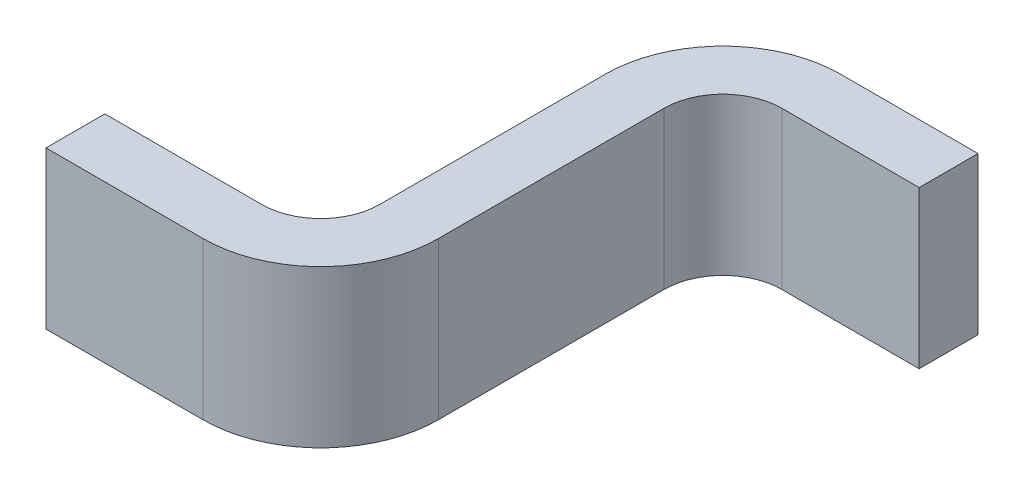
ISO-10303-21;
HEADER;
FILE_DESCRIPTION(('STEP AP214'),'2;1');
FILE_NAME('part.step','',(''),(''),'','','');
FILE_SCHEMA(('AUTOMOTIVE_DESIGN { 1 0 10303 214 1 1 1 1 }'));
ENDSEC;
DATA;
#1=APPLICATION_CONTEXT('core data for automotive mechanical design processes');
#2=APPLICATION_PROTOCOL_DEFINITION('international standard','automotive_design',2000,#1);
#3=PRODUCT_CONTEXT('',#1,'mechanical');
#4=PRODUCT('Part','Part','',(#3));
#5=PRODUCT_RELATED_PRODUCT_CATEGORY('part','',(#4));
#6=PRODUCT_DEFINITION_FORMATION('','',#4);
#7=PRODUCT_DEFINITION_CONTEXT('part definition',#1,'design');
#8=PRODUCT_DEFINITION('design','',#6,#7);
#9=PRODUCT_DEFINITION_SHAPE('','',#8);
#10=(LENGTH_UNIT() NAMED_UNIT(*) SI_UNIT(.MILLI.,.METRE.));
#11=(NAMED_UNIT(*) PLANE_ANGLE_UNIT() SI_UNIT($,.RADIAN.));
#12=(NAMED_UNIT(*) SI_UNIT($,.STERADIAN.) SOLID_ANGLE_UNIT());
#13=UNCERTAINTY_MEASURE_WITH_UNIT(LENGTH_MEASURE(1.E-05),#10,'distance_accuracy_value','');
#14=(GEOMETRIC_REPRESENTATION_CONTEXT(3) GLOBAL_UNCERTAINTY_ASSIGNED_CONTEXT((#13)) GLOBAL_UNIT_ASSIGNED_CONTEXT((#10,
#11,#12)) REPRESENTATION_CONTEXT('',''));
#15=CARTESIAN_POINT('',(0.,0.,0.));
#16=DIRECTION('',(0.,0.,1.));
#17=DIRECTION('',(1.,0.,0.));
#18=AXIS2_PLACEMENT_3D('',#15,#16,#17);
#19=CARTESIAN_POINT('',(3.15,1.47,0.));
#20=DIRECTION('',(0.,1.,0.));
#21=DIRECTION('',(1.,0.,0.));
#22=AXIS2_PLACEMENT_3D('',#19,#20,#21);
#23=PLANE('',#22);
#24=DIRECTION('',(-1.,0.,0.));
#25=VECTOR('',#24,1.);
#26=CARTESIAN_POINT('',(-2.475,1.47,0.));
#27=LINE('',#26,#25);
#28=CARTESIAN_POINT('',(3.4,1.47,0.));
#29=VERTEX_POINT('',#28);
#30=CARTESIAN_POINT('',(3.05,1.47,0.));
#31=VERTEX_POINT('',#30);
#32=EDGE_CURVE('E11',#29,#31,#27,.T.);
#33=ORIENTED_EDGE('',*,*,#32,.T.);
#34=CARTESIAN_POINT('',(3.05,1.47,0.3));
#35=DIRECTION('',(0.,-1.,0.));
#36=DIRECTION('',(0.,0.,-1.));
#37=AXIS2_PLACEMENT_3D('',#34,#35,#36);
#38=CIRCLE('',#37,0.3);
#39=CARTESIAN_POINT('',(2.75,1.47,0.3));
#40=VERTEX_POINT('',#39);
#41=EDGE_CURVE('E188',#40,#31,#38,.T.);
#42=ORIENTED_EDGE('',*,*,#41,.F.);
#43=DIRECTION('',(0.,0.,-1.));
#44=VECTOR('',#43,1.);
#45=CARTESIAN_POINT('',(2.75,1.47,1.175));
#46=LINE('',#45,#44);
#47=CARTESIAN_POINT('',(2.75,1.47,0.875));
#48=VERTEX_POINT('',#47);
#49=EDGE_CURVE('E200',#48,#40,#46,.T.);
#50=ORIENTED_EDGE('',*,*,#49,.F.);
#51=CARTESIAN_POINT('',(2.6,1.47,0.875));
#52=DIRECTION('',(0.,-1.,0.));
#53=DIRECTION('',(0.,0.,-1.));
#54=AXIS2_PLACEMENT_3D('',#51,#52,#53);
#55=CIRCLE('',#54,0.15);
#56=CARTESIAN_POINT('',(2.6,1.47,1.025));
#57=VERTEX_POINT('',#56);
#58=EDGE_CURVE('E203',#48,#57,#55,.T.);
#59=ORIENTED_EDGE('',*,*,#58,.T.);
#60=DIRECTION('',(-1.,0.,0.));
#61=VECTOR('',#60,1.);
#62=CARTESIAN_POINT('',(0.,1.47,1.025));
#63=LINE('',#62,#61);
#64=CARTESIAN_POINT('',(2.2,1.47,1.025));
#65=VERTEX_POINT('',#64);
#66=EDGE_CURVE('E210',#57,#65,#63,.T.);
#67=ORIENTED_EDGE('',*,*,#66,.T.);
#68=DIRECTION('',(0.,0.,-1.));
#69=VECTOR('',#68,1.);
#70=CARTESIAN_POINT('',(2.2,1.47,1.1));
#71=LINE('',#70,#69);
#72=CARTESIAN_POINT('',(2.2,1.47,1.175));
#73=VERTEX_POINT('',#72);
#74=EDGE_CURVE('E215',#73,#65,#71,.T.);
#75=ORIENTED_EDGE('',*,*,#74,.F.);
#76=DIRECTION('',(-1.,0.,0.));
#77=VECTOR('',#76,1.);
#78=CARTESIAN_POINT('',(-2.475,1.47,1.175));
#79=LINE('',#78,#77);
#80=CARTESIAN_POINT('',(2.6,1.47,1.175));
#81=VERTEX_POINT('',#80);
#82=EDGE_CURVE('E150',#81,#73,#79,.T.);
#83=ORIENTED_EDGE('',*,*,#82,.F.);
#84=CARTESIAN_POINT('',(2.6,1.47,0.875));
#85=DIRECTION('',(0.,-1.,0.));
#86=DIRECTION('',(0.,0.,-1.));
#87=AXIS2_PLACEMENT_3D('',#84,#85,#86);
#88=CIRCLE('',#87,0.3);
#89=CARTESIAN_POINT('',(2.9,1.47,0.875));
#90=VERTEX_POINT('',#89);
#91=EDGE_CURVE('E149',#90,#81,#88,.T.);
#92=ORIENTED_EDGE('',*,*,#91,.F.);
#93=DIRECTION('',(0.,0.,1.));
#94=VECTOR('',#93,1.);
#95=CARTESIAN_POINT('',(2.9,1.47,1.175));
#96=LINE('',#95,#94);
#97=CARTESIAN_POINT('',(2.9,1.47,0.3));
#98=VERTEX_POINT('',#97);
#99=EDGE_CURVE('E145',#98,#90,#96,.T.);
#100=ORIENTED_EDGE('',*,*,#99,.F.);
#101=CARTESIAN_POINT('',(3.05,1.47,0.3));
#102=DIRECTION('',(0.,-1.,0.));
#103=DIRECTION('',(0.,0.,-1.));
#104=AXIS2_PLACEMENT_3D('',#101,#102,#103);
#105=CIRCLE('',#104,0.15);
#106=CARTESIAN_POINT('',(3.05,1.47,0.15));
#107=VERTEX_POINT('',#106);
#108=EDGE_CURVE('E198',#98,#107,#105,.T.);
#109=ORIENTED_EDGE('',*,*,#108,.T.);
#110=DIRECTION('',(-1.,0.,0.));
#111=VECTOR('',#110,1.);
#112=CARTESIAN_POINT('',(0.,1.47,0.15));
#113=LINE('',#112,#111);
#114=CARTESIAN_POINT('',(3.4,1.47,0.15));
#115=VERTEX_POINT('',#114);
#116=EDGE_CURVE('E236',#115,#107,#113,.T.);
#117=ORIENTED_EDGE('',*,*,#116,.F.);
#118=DIRECTION('',(0.,0.,1.));
#119=VECTOR('',#118,1.);
#120=CARTESIAN_POINT('',(3.4,1.47,0.));
#121=LINE('',#120,#119);
#122=EDGE_CURVE('E26',#29,#115,#121,.T.);
#123=ORIENTED_EDGE('',*,*,#122,.F.);
#124=EDGE_LOOP('',(#33,#42,#50,#59,#67,#75,#83,#92,#100,#109,#117,#123));
#125=FACE_BOUND('',#124,.T.);
#126=ADVANCED_FACE('F17',(#125),#23,.T.);
#127=CARTESIAN_POINT('',(-2.475,1.27,0.));
#128=DIRECTION('',(0.,0.,1.));
#129=DIRECTION('',(1.,0.,0.));
#130=AXIS2_PLACEMENT_3D('',#127,#128,#129);
#131=PLANE('',#130);
#132=ORIENTED_EDGE('',*,*,#32,.F.);
#133=DIRECTION('',(0.,1.,0.));
#134=VECTOR('',#133,1.);
#135=CARTESIAN_POINT('',(3.4,1.27,0.));
#136=LINE('',#135,#134);
#137=CARTESIAN_POINT('',(3.4,1.07,0.));
#138=VERTEX_POINT('',#137);
#139=EDGE_CURVE('E239',#138,#29,#136,.T.);
#140=ORIENTED_EDGE('',*,*,#139,.F.);
#141=DIRECTION('',(1.,0.,0.));
#142=VECTOR('',#141,1.);
#143=CARTESIAN_POINT('',(2.825,1.07,0.));
#144=LINE('',#143,#142);
#145=CARTESIAN_POINT('',(3.05,1.07,0.));
#146=VERTEX_POINT('',#145);
#147=EDGE_CURVE('E384',#146,#138,#144,.T.);
#148=ORIENTED_EDGE('',*,*,#147,.F.);
#149=DIRECTION('',(0.,-1.,0.));
#150=VECTOR('',#149,1.);
#151=CARTESIAN_POINT('',(3.05,1.27,0.));
#152=LINE('',#151,#150);
#153=EDGE_CURVE('E189',#31,#146,#152,.T.);
#154=ORIENTED_EDGE('',*,*,#153,.F.);
#155=EDGE_LOOP('',(#132,#140,#148,#154));
#156=FACE_BOUND('',#155,.T.);
#157=ADVANCED_FACE('F452',(#156),#131,.F.);
#158=CARTESIAN_POINT('',(3.4,1.27,0.));
#159=DIRECTION('',(1.,0.,0.));
#160=DIRECTION('',(0.,1.,0.));
#161=AXIS2_PLACEMENT_3D('',#158,#159,#160);
#162=PLANE('',#161);
#163=ORIENTED_EDGE('',*,*,#139,.T.);
#164=ORIENTED_EDGE('',*,*,#122,.T.);
#165=DIRECTION('',(0.,1.,0.));
#166=VECTOR('',#165,1.);
#167=CARTESIAN_POINT('',(3.4,0.,0.15));
#168=LINE('',#167,#166);
#169=CARTESIAN_POINT('',(3.4,1.07,0.15));
#170=VERTEX_POINT('',#169);
#171=EDGE_CURVE('E232',#170,#115,#168,.T.);
#172=ORIENTED_EDGE('',*,*,#171,.F.);
#173=DIRECTION('',(0.,0.,1.));
#174=VECTOR('',#173,1.);
#175=CARTESIAN_POINT('',(3.4,1.07,1.175));
#176=LINE('',#175,#174);
#177=EDGE_CURVE('E388',#138,#170,#176,.T.);
#178=ORIENTED_EDGE('',*,*,#177,.F.);
#179=EDGE_LOOP('',(#163,#164,#172,#178));
#180=FACE_BOUND('',#179,.T.);
#181=ADVANCED_FACE('F453',(#180),#162,.T.);
#182=CARTESIAN_POINT('',(0.,0.,0.15));
#183=DIRECTION('',(0.,0.,1.));
#184=DIRECTION('',(1.,0.,0.));
#185=AXIS2_PLACEMENT_3D('',#182,#183,#184);
#186=PLANE('',#185);
#187=ORIENTED_EDGE('',*,*,#171,.T.);
#188=ORIENTED_EDGE('',*,*,#116,.T.);
#189=DIRECTION('',(0.,-1.,0.));
#190=VECTOR('',#189,1.);
#191=CARTESIAN_POINT('',(3.05,0.635,0.15));
#192=LINE('',#191,#190);
#193=CARTESIAN_POINT('',(3.05,1.07,0.15));
#194=VERTEX_POINT('',#193);
#195=EDGE_CURVE('E229',#107,#194,#192,.T.);
#196=ORIENTED_EDGE('',*,*,#195,.T.);
#197=DIRECTION('',(-1.,0.,0.));
#198=VECTOR('',#197,1.);
#199=CARTESIAN_POINT('',(2.825,1.07,0.15));
#200=LINE('',#199,#198);
#201=EDGE_CURVE('E174',#170,#194,#200,.T.);
#202=ORIENTED_EDGE('',*,*,#201,.F.);
#203=EDGE_LOOP('',(#187,#188,#196,#202));
#204=FACE_BOUND('',#203,.T.);
#205=ADVANCED_FACE('F19',(#204),#186,.T.);
#206=CARTESIAN_POINT('',(3.05,0.635,0.3));
#207=DIRECTION('',(0.,-1.,0.));
#208=DIRECTION('',(0.,0.,-1.));
#209=AXIS2_PLACEMENT_3D('',#206,#207,#208);
#210=CYLINDRICAL_SURFACE('',#209,0.15);
#211=ORIENTED_EDGE('',*,*,#108,.F.);
#212=DIRECTION('',(0.,1.,0.));
#213=VECTOR('',#212,1.);
#214=CARTESIAN_POINT('',(2.9,1.27,0.3));
#215=LINE('',#214,#213);
#216=CARTESIAN_POINT('',(2.9,1.07,0.3));
#217=VERTEX_POINT('',#216);
#218=EDGE_CURVE('E199',#217,#98,#215,.T.);
#219=ORIENTED_EDGE('',*,*,#218,.F.);
#220=CARTESIAN_POINT('',(3.05,1.07,0.3));
#221=DIRECTION('',(0.,1.,0.));
#222=DIRECTION('',(0.,0.,-1.));
#223=AXIS2_PLACEMENT_3D('',#220,#221,#222);
#224=CIRCLE('',#223,0.15);
#225=EDGE_CURVE('E167',#194,#217,#224,.T.);
#226=ORIENTED_EDGE('',*,*,#225,.F.);
#227=ORIENTED_EDGE('',*,*,#195,.F.);
#228=EDGE_LOOP('',(#211,#219,#226,#227));
#229=FACE_BOUND('',#228,.T.);
#230=ADVANCED_FACE('F427',(#229),#210,.F.);
#231=CARTESIAN_POINT('',(2.9,1.27,1.175));
#232=DIRECTION('',(1.,0.,0.));
#233=DIRECTION('',(0.,1.,0.));
#234=AXIS2_PLACEMENT_3D('',#231,#232,#233);
#235=PLANE('',#234);
#236=DIRECTION('',(0.,1.,0.));
#237=VECTOR('',#236,1.);
#238=CARTESIAN_POINT('',(2.9,1.27,0.875));
#239=LINE('',#238,#237);
#240=CARTESIAN_POINT('',(2.9,1.07,0.875));
#241=VERTEX_POINT('',#240);
#242=EDGE_CURVE('E137',#241,#90,#239,.T.);
#243=ORIENTED_EDGE('',*,*,#242,.F.);
#244=DIRECTION('',(0.,0.,1.));
#245=VECTOR('',#244,1.);
#246=CARTESIAN_POINT('',(2.9,1.07,1.175));
#247=LINE('',#246,#245);
#248=EDGE_CURVE('E142',#217,#241,#247,.T.);
#249=ORIENTED_EDGE('',*,*,#248,.F.);
#250=ORIENTED_EDGE('',*,*,#218,.T.);
#251=ORIENTED_EDGE('',*,*,#99,.T.);
#252=EDGE_LOOP('',(#243,#249,#250,#251));
#253=FACE_BOUND('',#252,.T.);
#254=ADVANCED_FACE('F139',(#253),#235,.T.);
#255=CARTESIAN_POINT('',(2.6,1.27,0.875));
#256=DIRECTION('',(0.,-1.,0.));
#257=DIRECTION('',(0.,0.,-1.));
#258=AXIS2_PLACEMENT_3D('',#255,#256,#257);
#259=CYLINDRICAL_SURFACE('',#258,0.3);
#260=DIRECTION('',(0.,1.,0.));
#261=VECTOR('',#260,1.);
#262=CARTESIAN_POINT('',(2.6,1.27,1.175));
#263=LINE('',#262,#261);
#264=CARTESIAN_POINT('',(2.6,1.07,1.175));
#265=VERTEX_POINT('',#264);
#266=EDGE_CURVE('E156',#265,#81,#263,.T.);
#267=ORIENTED_EDGE('',*,*,#266,.F.);
#268=CARTESIAN_POINT('',(2.6,1.07,0.875));
#269=DIRECTION('',(0.,-1.,0.));
#270=DIRECTION('',(0.,0.,-1.));
#271=AXIS2_PLACEMENT_3D('',#268,#269,#270);
#272=CIRCLE('',#271,0.3);
#273=EDGE_CURVE('E153',#241,#265,#272,.T.);
#274=ORIENTED_EDGE('',*,*,#273,.F.);
#275=ORIENTED_EDGE('',*,*,#242,.T.);
#276=ORIENTED_EDGE('',*,*,#91,.T.);
#277=EDGE_LOOP('',(#267,#274,#275,#276));
#278=FACE_BOUND('',#277,.T.);
#279=ADVANCED_FACE('F154',(#278),#259,.T.);
#280=CARTESIAN_POINT('',(-2.475,1.27,1.175));
#281=DIRECTION('',(0.,0.,1.));
#282=DIRECTION('',(1.,0.,0.));
#283=AXIS2_PLACEMENT_3D('',#280,#281,#282);
#284=PLANE('',#283);
#285=DIRECTION('',(0.,1.,0.));
#286=VECTOR('',#285,1.);
#287=CARTESIAN_POINT('',(2.2,1.27,1.175));
#288=LINE('',#287,#286);
#289=CARTESIAN_POINT('',(2.2,1.07,1.175));
#290=VERTEX_POINT('',#289);
#291=EDGE_CURVE('E214',#290,#73,#288,.T.);
#292=ORIENTED_EDGE('',*,*,#291,.F.);
#293=DIRECTION('',(-1.,0.,0.));
#294=VECTOR('',#293,1.);
#295=CARTESIAN_POINT('',(2.825,1.07,1.175));
#296=LINE('',#295,#294);
#297=EDGE_CURVE('E161',#265,#290,#296,.T.);
#298=ORIENTED_EDGE('',*,*,#297,.F.);
#299=ORIENTED_EDGE('',*,*,#266,.T.);
#300=ORIENTED_EDGE('',*,*,#82,.T.);
#301=EDGE_LOOP('',(#292,#298,#299,#300));
#302=FACE_BOUND('',#301,.T.);
#303=ADVANCED_FACE('F432',(#302),#284,.T.);
#304=CARTESIAN_POINT('',(2.2,1.27,1.1));
#305=DIRECTION('',(-1.,0.,0.));
#306=DIRECTION('',(0.,0.,1.));
#307=AXIS2_PLACEMENT_3D('',#304,#305,#306);
#308=PLANE('',#307);
#309=ORIENTED_EDGE('',*,*,#291,.T.);
#310=ORIENTED_EDGE('',*,*,#74,.T.);
#311=DIRECTION('',(0.,-1.,0.));
#312=VECTOR('',#311,1.);
#313=CARTESIAN_POINT('',(2.2,0.,1.025));
#314=LINE('',#313,#312);
#315=CARTESIAN_POINT('',(2.2,1.07,1.025));
#316=VERTEX_POINT('',#315);
#317=EDGE_CURVE('E207',#65,#316,#314,.T.);
#318=ORIENTED_EDGE('',*,*,#317,.T.);
#319=DIRECTION('',(0.,0.,-1.));
#320=VECTOR('',#319,1.);
#321=CARTESIAN_POINT('',(2.2,1.07,1.175));
#322=LINE('',#321,#320);
#323=EDGE_CURVE('E183',#290,#316,#322,.T.);
#324=ORIENTED_EDGE('',*,*,#323,.F.);
#325=EDGE_LOOP('',(#309,#310,#318,#324));
#326=FACE_BOUND('',#325,.T.);
#327=ADVANCED_FACE('F436',(#326),#308,.T.);
#328=CARTESIAN_POINT('',(0.,0.,1.025));
#329=DIRECTION('',(0.,0.,1.));
#330=DIRECTION('',(1.,0.,0.));
#331=AXIS2_PLACEMENT_3D('',#328,#329,#330);
#332=PLANE('',#331);
#333=DIRECTION('',(1.,0.,0.));
#334=VECTOR('',#333,1.);
#335=CARTESIAN_POINT('',(2.825,1.07,1.025));
#336=LINE('',#335,#334);
#337=CARTESIAN_POINT('',(2.6,1.07,1.025));
#338=VERTEX_POINT('',#337);
#339=EDGE_CURVE('E178',#316,#338,#336,.T.);
#340=ORIENTED_EDGE('',*,*,#339,.F.);
#341=ORIENTED_EDGE('',*,*,#317,.F.);
#342=ORIENTED_EDGE('',*,*,#66,.F.);
#343=DIRECTION('',(0.,-1.,0.));
#344=VECTOR('',#343,1.);
#345=CARTESIAN_POINT('',(2.6,0.635,1.025));
#346=LINE('',#345,#344);
#347=EDGE_CURVE('E204',#57,#338,#346,.T.);
#348=ORIENTED_EDGE('',*,*,#347,.T.);
#349=EDGE_LOOP('',(#340,#341,#342,#348));
#350=FACE_BOUND('',#349,.T.);
#351=ADVANCED_FACE('F439',(#350),#332,.F.);
#352=CARTESIAN_POINT('',(2.6,0.635,0.875));
#353=DIRECTION('',(0.,-1.,0.));
#354=DIRECTION('',(0.,0.,-1.));
#355=AXIS2_PLACEMENT_3D('',#352,#353,#354);
#356=CYLINDRICAL_SURFACE('',#355,0.15);
#357=ORIENTED_EDGE('',*,*,#58,.F.);
#358=DIRECTION('',(0.,1.,0.));
#359=VECTOR('',#358,1.);
#360=CARTESIAN_POINT('',(2.75,1.27,0.875));
#361=LINE('',#360,#359);
#362=CARTESIAN_POINT('',(2.75,1.07,0.875));
#363=VERTEX_POINT('',#362);
#364=EDGE_CURVE('E192',#363,#48,#361,.T.);
#365=ORIENTED_EDGE('',*,*,#364,.F.);
#366=CARTESIAN_POINT('',(2.6,1.07,0.875));
#367=DIRECTION('',(0.,1.,0.));
#368=DIRECTION('',(0.,0.,-1.));
#369=AXIS2_PLACEMENT_3D('',#366,#367,#368);
#370=CIRCLE('',#369,0.15);
#371=EDGE_CURVE('E182',#338,#363,#370,.T.);
#372=ORIENTED_EDGE('',*,*,#371,.F.);
#373=ORIENTED_EDGE('',*,*,#347,.F.);
#374=EDGE_LOOP('',(#357,#365,#372,#373));
#375=FACE_BOUND('',#374,.T.);
#376=ADVANCED_FACE('F443',(#375),#356,.F.);
#377=CARTESIAN_POINT('',(2.75,1.27,1.175));
#378=DIRECTION('',(-1.,0.,0.));
#379=DIRECTION('',(0.,0.,1.));
#380=AXIS2_PLACEMENT_3D('',#377,#378,#379);
#381=PLANE('',#380);
#382=ORIENTED_EDGE('',*,*,#364,.T.);
#383=ORIENTED_EDGE('',*,*,#49,.T.);
#384=DIRECTION('',(0.,1.,0.));
#385=VECTOR('',#384,1.);
#386=CARTESIAN_POINT('',(2.75,1.27,0.3));
#387=LINE('',#386,#385);
#388=CARTESIAN_POINT('',(2.75,1.07,0.3));
#389=VERTEX_POINT('',#388);
#390=EDGE_CURVE('E184',#389,#40,#387,.T.);
#391=ORIENTED_EDGE('',*,*,#390,.F.);
#392=DIRECTION('',(0.,0.,-1.));
#393=VECTOR('',#392,1.);
#394=CARTESIAN_POINT('',(2.75,1.07,1.175));
#395=LINE('',#394,#393);
#396=EDGE_CURVE('E400',#363,#389,#395,.T.);
#397=ORIENTED_EDGE('',*,*,#396,.F.);
#398=EDGE_LOOP('',(#382,#383,#391,#397));
#399=FACE_BOUND('',#398,.T.);
#400=ADVANCED_FACE('F445',(#399),#381,.T.);
#401=CARTESIAN_POINT('',(3.05,1.27,0.3));
#402=DIRECTION('',(0.,-1.,0.));
#403=DIRECTION('',(0.,0.,-1.));
#404=AXIS2_PLACEMENT_3D('',#401,#402,#403);
#405=CYLINDRICAL_SURFACE('',#404,0.3);
#406=ORIENTED_EDGE('',*,*,#390,.T.);
#407=ORIENTED_EDGE('',*,*,#41,.T.);
#408=ORIENTED_EDGE('',*,*,#153,.T.);
#409=CARTESIAN_POINT('',(3.05,1.07,0.3));
#410=DIRECTION('',(0.,-1.,0.));
#411=DIRECTION('',(0.,0.,-1.));
#412=AXIS2_PLACEMENT_3D('',#409,#410,#411);
#413=CIRCLE('',#412,0.3);
#414=EDGE_CURVE('E389',#389,#146,#413,.T.);
#415=ORIENTED_EDGE('',*,*,#414,.F.);
#416=EDGE_LOOP('',(#406,#407,#408,#415));
#417=FACE_BOUND('',#416,.T.);
#418=ADVANCED_FACE('F450',(#417),#405,.T.);
#419=CARTESIAN_POINT('',(2.825,1.07,1.175));
#420=DIRECTION('',(0.,-1.,0.));
#421=DIRECTION('',(0.,0.,-1.));
#422=AXIS2_PLACEMENT_3D('',#419,#420,#421);
#423=PLANE('',#422);
#424=ORIENTED_EDGE('',*,*,#396,.T.);
#425=ORIENTED_EDGE('',*,*,#414,.T.);
#426=ORIENTED_EDGE('',*,*,#147,.T.);
#427=ORIENTED_EDGE('',*,*,#177,.T.);
#428=ORIENTED_EDGE('',*,*,#201,.T.);
#429=ORIENTED_EDGE('',*,*,#225,.T.);
#430=ORIENTED_EDGE('',*,*,#248,.T.);
#431=ORIENTED_EDGE('',*,*,#273,.T.);
#432=ORIENTED_EDGE('',*,*,#297,.T.);
#433=ORIENTED_EDGE('',*,*,#323,.T.);
#434=ORIENTED_EDGE('',*,*,#339,.T.);
#435=ORIENTED_EDGE('',*,*,#371,.T.);
#436=EDGE_LOOP('',(#424,#425,#426,#427,#428,#429,#430,#431,#432,#433,#434,#435));
#437=FACE_BOUND('',#436,.T.);
#438=ADVANCED_FACE('F164',(#437),#423,.T.);
#439=CLOSED_SHELL('',(#126,#157,#181,#205,#230,#254,#279,#303,#327,#351,#376,#400,#418,#438));
#440=MANIFOLD_SOLID_BREP('B1',#439);
#441=ADVANCED_BREP_SHAPE_REPRESENTATION('',(#18,#440),#14);
#442=SHAPE_DEFINITION_REPRESENTATION(#9,#441);
ENDSEC;
END-ISO-10303-21;
